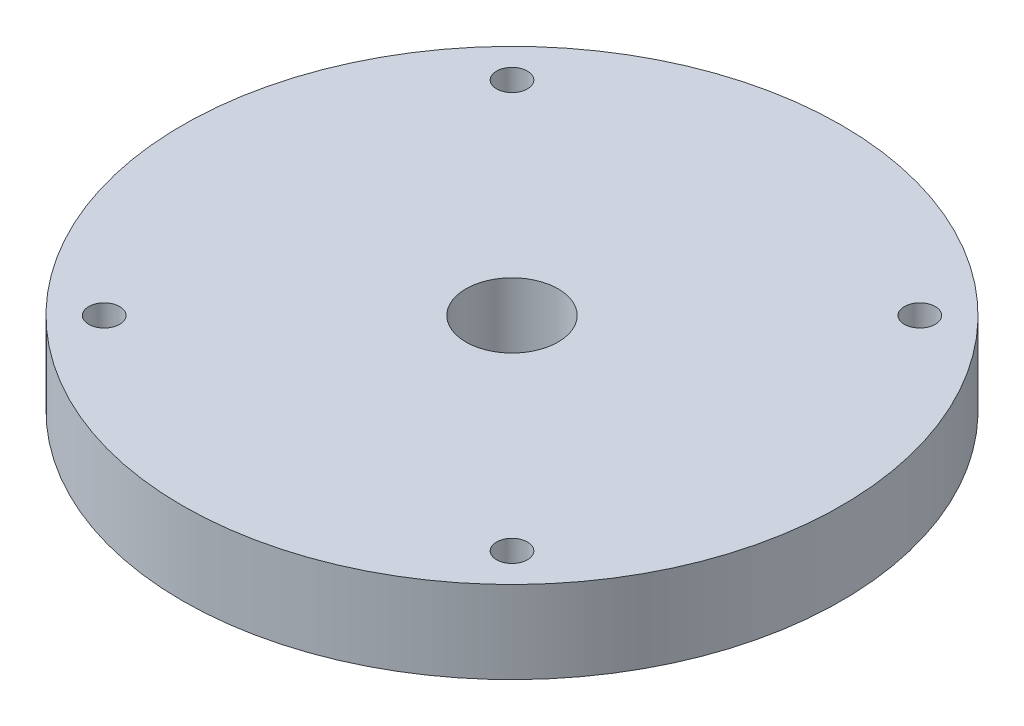
ISO-10303-21;
HEADER;
FILE_DESCRIPTION(('STEP AP214'),'2;1');
FILE_NAME('part.step','',(''),(''),'','','');
FILE_SCHEMA(('AUTOMOTIVE_DESIGN { 1 0 10303 214 1 1 1 1 }'));
ENDSEC;
DATA;
#1=APPLICATION_CONTEXT('core data for automotive mechanical design processes');
#2=APPLICATION_PROTOCOL_DEFINITION('international standard','automotive_design',2000,#1);
#3=PRODUCT_CONTEXT('',#1,'mechanical');
#4=PRODUCT('Part','Part','',(#3));
#5=PRODUCT_RELATED_PRODUCT_CATEGORY('part','',(#4));
#6=PRODUCT_DEFINITION_FORMATION('','',#4);
#7=PRODUCT_DEFINITION_CONTEXT('part definition',#1,'design');
#8=PRODUCT_DEFINITION('design','',#6,#7);
#9=PRODUCT_DEFINITION_SHAPE('','',#8);
#10=(LENGTH_UNIT() NAMED_UNIT(*) SI_UNIT(.MILLI.,.METRE.));
#11=(NAMED_UNIT(*) PLANE_ANGLE_UNIT() SI_UNIT($,.RADIAN.));
#12=(NAMED_UNIT(*) SI_UNIT($,.STERADIAN.) SOLID_ANGLE_UNIT());
#13=UNCERTAINTY_MEASURE_WITH_UNIT(LENGTH_MEASURE(1.E-05),#10,'distance_accuracy_value','');
#14=(GEOMETRIC_REPRESENTATION_CONTEXT(3) GLOBAL_UNCERTAINTY_ASSIGNED_CONTEXT((#13)) GLOBAL_UNIT_ASSIGNED_CONTEXT((#10,
#11,#12)) REPRESENTATION_CONTEXT('',''));
#15=CARTESIAN_POINT('',(0.,0.,0.));
#16=DIRECTION('',(0.,0.,1.));
#17=DIRECTION('',(1.,0.,0.));
#18=AXIS2_PLACEMENT_3D('',#15,#16,#17);
#19=CARTESIAN_POINT('',(0.,6.35,0.));
#20=DIRECTION('',(0.,1.,0.));
#21=DIRECTION('',(0.,0.,1.));
#22=AXIS2_PLACEMENT_3D('',#19,#20,#21);
#23=PLANE('',#22);
#24=CARTESIAN_POINT('',(-15.7154482118708,6.35,15.7154482118712));
#25=DIRECTION('',(0.,1.,0.));
#26=DIRECTION('',(0.,0.,1.));
#27=AXIS2_PLACEMENT_3D('',#24,#25,#26);
#28=CIRCLE('',#27,1.190625);
#29=CARTESIAN_POINT('',(-15.7154482118708,6.35,16.9060732118712));
#30=VERTEX_POINT('',#29);
#31=EDGE_CURVE('E59',#30,#30,#28,.T.);
#32=ORIENTED_EDGE('',*,*,#31,.F.);
#33=EDGE_LOOP('',(#32));
#34=FACE_BOUND('',#33,.T.);
#35=CARTESIAN_POINT('',(15.7154482118711,6.35,-15.7154482118708));
#36=DIRECTION('',(0.,1.,0.));
#37=DIRECTION('',(0.,0.,1.));
#38=AXIS2_PLACEMENT_3D('',#35,#36,#37);
#39=CIRCLE('',#38,1.190625);
#40=CARTESIAN_POINT('',(15.7154482118711,6.35,-14.5248232118708));
#41=VERTEX_POINT('',#40);
#42=EDGE_CURVE('E47',#41,#41,#39,.T.);
#43=ORIENTED_EDGE('',*,*,#42,.F.);
#44=EDGE_LOOP('',(#43));
#45=FACE_BOUND('',#44,.T.);
#46=CARTESIAN_POINT('',(0.,6.35,0.));
#47=DIRECTION('',(0.,1.,0.));
#48=DIRECTION('',(0.,0.,1.));
#49=AXIS2_PLACEMENT_3D('',#46,#47,#48);
#50=CIRCLE('',#49,25.4);
#51=CARTESIAN_POINT('',(0.,6.35,25.4000000000001));
#52=VERTEX_POINT('',#51);
#53=EDGE_CURVE('E10',#52,#52,#50,.T.);
#54=ORIENTED_EDGE('',*,*,#53,.T.);
#55=EDGE_LOOP('',(#54));
#56=FACE_BOUND('',#55,.T.);
#57=CARTESIAN_POINT('',(-15.715448211868,6.35,-15.7154482118742));
#58=DIRECTION('',(0.,1.,0.));
#59=DIRECTION('',(0.,0.,1.));
#60=AXIS2_PLACEMENT_3D('',#57,#58,#59);
#61=CIRCLE('',#60,1.19062499999856);
#62=CARTESIAN_POINT('',(-15.715448211868,6.35,-14.5248232118757));
#63=VERTEX_POINT('',#62);
#64=EDGE_CURVE('E42',#63,#63,#61,.T.);
#65=ORIENTED_EDGE('',*,*,#64,.F.);
#66=EDGE_LOOP('',(#65));
#67=FACE_BOUND('',#66,.T.);
#68=CARTESIAN_POINT('',(15.7154482118714,6.35,15.715448211871));
#69=DIRECTION('',(0.,1.,0.));
#70=DIRECTION('',(0.,0.,1.));
#71=AXIS2_PLACEMENT_3D('',#68,#69,#70);
#72=CIRCLE('',#71,1.190625);
#73=CARTESIAN_POINT('',(15.7154482118714,6.35,16.906073211871));
#74=VERTEX_POINT('',#73);
#75=EDGE_CURVE('E53',#74,#74,#72,.T.);
#76=ORIENTED_EDGE('',*,*,#75,.F.);
#77=EDGE_LOOP('',(#76));
#78=FACE_BOUND('',#77,.T.);
#79=CARTESIAN_POINT('',(2.90099114436481E-12,6.35,-3.11956630233812E-12));
#80=DIRECTION('',(0.,1.,0.));
#81=DIRECTION('',(0.,0.,1.));
#82=AXIS2_PLACEMENT_3D('',#79,#80,#81);
#83=CIRCLE('',#82,3.55599999999741);
#84=CARTESIAN_POINT('',(2.90099114436481E-12,6.35,3.55599999999429));
#85=VERTEX_POINT('',#84);
#86=EDGE_CURVE('E65',#85,#85,#83,.T.);
#87=ORIENTED_EDGE('',*,*,#86,.F.);
#88=EDGE_LOOP('',(#87));
#89=FACE_BOUND('',#88,.T.);
#90=ADVANCED_FACE('F31',(#34,#45,#56,#67,#78,#89),#23,.T.);
#91=CARTESIAN_POINT('',(0.,0.,0.));
#92=DIRECTION('',(0.,1.,0.));
#93=DIRECTION('',(0.,0.,1.));
#94=AXIS2_PLACEMENT_3D('',#91,#92,#93);
#95=PLANE('',#94);
#96=CARTESIAN_POINT('',(-15.7154482118708,0.,15.7154482118712));
#97=DIRECTION('',(0.,1.,0.));
#98=DIRECTION('',(0.,0.,1.));
#99=AXIS2_PLACEMENT_3D('',#96,#97,#98);
#100=CIRCLE('',#99,1.190625);
#101=CARTESIAN_POINT('',(-15.7154482118708,0.,16.9060732118712));
#102=VERTEX_POINT('',#101);
#103=EDGE_CURVE('E62',#102,#102,#100,.T.);
#104=ORIENTED_EDGE('',*,*,#103,.T.);
#105=EDGE_LOOP('',(#104));
#106=FACE_BOUND('',#105,.T.);
#107=CARTESIAN_POINT('',(15.7154482118711,0.,-15.7154482118708));
#108=DIRECTION('',(0.,1.,0.));
#109=DIRECTION('',(0.,0.,1.));
#110=AXIS2_PLACEMENT_3D('',#107,#108,#109);
#111=CIRCLE('',#110,1.190625);
#112=CARTESIAN_POINT('',(15.7154482118711,0.,-14.5248232118708));
#113=VERTEX_POINT('',#112);
#114=EDGE_CURVE('E50',#113,#113,#111,.T.);
#115=ORIENTED_EDGE('',*,*,#114,.T.);
#116=EDGE_LOOP('',(#115));
#117=FACE_BOUND('',#116,.T.);
#118=CARTESIAN_POINT('',(0.,0.,0.));
#119=DIRECTION('',(0.,1.,0.));
#120=DIRECTION('',(0.,0.,1.));
#121=AXIS2_PLACEMENT_3D('',#118,#119,#120);
#122=CIRCLE('',#121,25.4);
#123=CARTESIAN_POINT('',(0.,0.,25.4000000000001));
#124=VERTEX_POINT('',#123);
#125=EDGE_CURVE('E35',#124,#124,#122,.T.);
#126=ORIENTED_EDGE('',*,*,#125,.F.);
#127=EDGE_LOOP('',(#126));
#128=FACE_BOUND('',#127,.T.);
#129=CARTESIAN_POINT('',(-15.715448211868,0.,-15.7154482118742));
#130=DIRECTION('',(0.,1.,0.));
#131=DIRECTION('',(0.,0.,1.));
#132=AXIS2_PLACEMENT_3D('',#129,#130,#131);
#133=CIRCLE('',#132,1.19062499999856);
#134=CARTESIAN_POINT('',(-15.715448211868,0.,-14.5248232118757));
#135=VERTEX_POINT('',#134);
#136=EDGE_CURVE('E44',#135,#135,#133,.T.);
#137=ORIENTED_EDGE('',*,*,#136,.T.);
#138=EDGE_LOOP('',(#137));
#139=FACE_BOUND('',#138,.T.);
#140=CARTESIAN_POINT('',(15.7154482118714,0.,15.715448211871));
#141=DIRECTION('',(0.,1.,0.));
#142=DIRECTION('',(0.,0.,1.));
#143=AXIS2_PLACEMENT_3D('',#140,#141,#142);
#144=CIRCLE('',#143,1.190625);
#145=CARTESIAN_POINT('',(15.7154482118714,0.,16.906073211871));
#146=VERTEX_POINT('',#145);
#147=EDGE_CURVE('E56',#146,#146,#144,.T.);
#148=ORIENTED_EDGE('',*,*,#147,.T.);
#149=EDGE_LOOP('',(#148));
#150=FACE_BOUND('',#149,.T.);
#151=CARTESIAN_POINT('',(2.90099114436481E-12,0.,-3.11956630233812E-12));
#152=DIRECTION('',(0.,1.,0.));
#153=DIRECTION('',(0.,0.,1.));
#154=AXIS2_PLACEMENT_3D('',#151,#152,#153);
#155=CIRCLE('',#154,3.55599999999741);
#156=CARTESIAN_POINT('',(2.90099114436481E-12,0.,3.55599999999429));
#157=VERTEX_POINT('',#156);
#158=EDGE_CURVE('E68',#157,#157,#155,.T.);
#159=ORIENTED_EDGE('',*,*,#158,.T.);
#160=EDGE_LOOP('',(#159));
#161=FACE_BOUND('',#160,.T.);
#162=ADVANCED_FACE('F78',(#106,#117,#128,#139,#150,#161),#95,.F.);
#163=CARTESIAN_POINT('',(0.,6.35,0.));
#164=DIRECTION('',(0.,-1.,0.));
#165=DIRECTION('',(0.,0.,-1.));
#166=AXIS2_PLACEMENT_3D('',#163,#164,#165);
#167=CYLINDRICAL_SURFACE('',#166,25.4);
#168=ORIENTED_EDGE('',*,*,#53,.F.);
#169=EDGE_LOOP('',(#168));
#170=FACE_BOUND('',#169,.T.);
#171=ORIENTED_EDGE('',*,*,#125,.T.);
#172=EDGE_LOOP('',(#171));
#173=FACE_BOUND('',#172,.T.);
#174=ADVANCED_FACE('F33',(#170,#173),#167,.T.);
#175=CARTESIAN_POINT('',(-15.715448211868,6.35,-15.7154482118742));
#176=DIRECTION('',(0.,-1.,0.));
#177=DIRECTION('',(0.,0.,-1.));
#178=AXIS2_PLACEMENT_3D('',#175,#176,#177);
#179=CYLINDRICAL_SURFACE('',#178,1.19062499999856);
#180=ORIENTED_EDGE('',*,*,#64,.T.);
#181=EDGE_LOOP('',(#180));
#182=FACE_BOUND('',#181,.T.);
#183=ORIENTED_EDGE('',*,*,#136,.F.);
#184=EDGE_LOOP('',(#183));
#185=FACE_BOUND('',#184,.T.);
#186=ADVANCED_FACE('F88',(#182,#185),#179,.F.);
#187=CARTESIAN_POINT('',(15.7154482118711,6.35,-15.7154482118708));
#188=DIRECTION('',(0.,-1.,0.));
#189=DIRECTION('',(0.,0.,-1.));
#190=AXIS2_PLACEMENT_3D('',#187,#188,#189);
#191=CYLINDRICAL_SURFACE('',#190,1.190625);
#192=ORIENTED_EDGE('',*,*,#42,.T.);
#193=EDGE_LOOP('',(#192));
#194=FACE_BOUND('',#193,.T.);
#195=ORIENTED_EDGE('',*,*,#114,.F.);
#196=EDGE_LOOP('',(#195));
#197=FACE_BOUND('',#196,.T.);
#198=ADVANCED_FACE('F91',(#194,#197),#191,.F.);
#199=CARTESIAN_POINT('',(15.7154482118714,6.35,15.715448211871));
#200=DIRECTION('',(0.,-1.,0.));
#201=DIRECTION('',(0.,0.,-1.));
#202=AXIS2_PLACEMENT_3D('',#199,#200,#201);
#203=CYLINDRICAL_SURFACE('',#202,1.190625);
#204=ORIENTED_EDGE('',*,*,#75,.T.);
#205=EDGE_LOOP('',(#204));
#206=FACE_BOUND('',#205,.T.);
#207=ORIENTED_EDGE('',*,*,#147,.F.);
#208=EDGE_LOOP('',(#207));
#209=FACE_BOUND('',#208,.T.);
#210=ADVANCED_FACE('F95',(#206,#209),#203,.F.);
#211=CARTESIAN_POINT('',(-15.7154482118708,6.35,15.7154482118712));
#212=DIRECTION('',(0.,-1.,0.));
#213=DIRECTION('',(0.,0.,-1.));
#214=AXIS2_PLACEMENT_3D('',#211,#212,#213);
#215=CYLINDRICAL_SURFACE('',#214,1.190625);
#216=ORIENTED_EDGE('',*,*,#31,.T.);
#217=EDGE_LOOP('',(#216));
#218=FACE_BOUND('',#217,.T.);
#219=ORIENTED_EDGE('',*,*,#103,.F.);
#220=EDGE_LOOP('',(#219));
#221=FACE_BOUND('',#220,.T.);
#222=ADVANCED_FACE('F99',(#218,#221),#215,.F.);
#223=CARTESIAN_POINT('',(2.90099114436481E-12,6.35,-3.11956630233812E-12));
#224=DIRECTION('',(0.,-1.,0.));
#225=DIRECTION('',(0.,0.,-1.));
#226=AXIS2_PLACEMENT_3D('',#223,#224,#225);
#227=CYLINDRICAL_SURFACE('',#226,3.55599999999741);
#228=ORIENTED_EDGE('',*,*,#86,.T.);
#229=EDGE_LOOP('',(#228));
#230=FACE_BOUND('',#229,.T.);
#231=ORIENTED_EDGE('',*,*,#158,.F.);
#232=EDGE_LOOP('',(#231));
#233=FACE_BOUND('',#232,.T.);
#234=ADVANCED_FACE('F74',(#230,#233),#227,.F.);
#235=CLOSED_SHELL('',(#90,#162,#174,#186,#198,#210,#222,#234));
#236=MANIFOLD_SOLID_BREP('B2',#235);
#237=ADVANCED_BREP_SHAPE_REPRESENTATION('',(#18,#236),#14);
#238=SHAPE_DEFINITION_REPRESENTATION(#9,#237);
ENDSEC;
END-ISO-10303-21;
